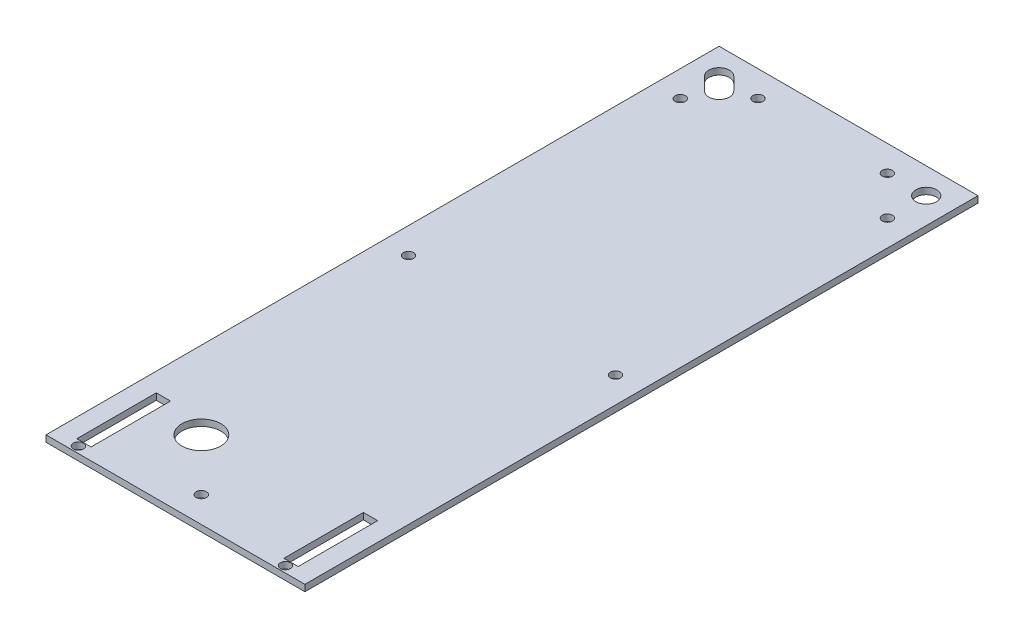
ISO-10303-21;
HEADER;
FILE_DESCRIPTION(('STEP AP214'),'2;1');
FILE_NAME('part.step','',(''),(''),'','','');
FILE_SCHEMA(('AUTOMOTIVE_DESIGN { 1 0 10303 214 1 1 1 1 }'));
ENDSEC;
DATA;
#1=APPLICATION_CONTEXT('core data for automotive mechanical design processes');
#2=APPLICATION_PROTOCOL_DEFINITION('international standard','automotive_design',2000,#1);
#3=PRODUCT_CONTEXT('',#1,'mechanical');
#4=PRODUCT('Part','Part','',(#3));
#5=PRODUCT_RELATED_PRODUCT_CATEGORY('part','',(#4));
#6=PRODUCT_DEFINITION_FORMATION('','',#4);
#7=PRODUCT_DEFINITION_CONTEXT('part definition',#1,'design');
#8=PRODUCT_DEFINITION('design','',#6,#7);
#9=PRODUCT_DEFINITION_SHAPE('','',#8);
#10=(LENGTH_UNIT() NAMED_UNIT(*) SI_UNIT(.MILLI.,.METRE.));
#11=(NAMED_UNIT(*) PLANE_ANGLE_UNIT() SI_UNIT($,.RADIAN.));
#12=(NAMED_UNIT(*) SI_UNIT($,.STERADIAN.) SOLID_ANGLE_UNIT());
#13=UNCERTAINTY_MEASURE_WITH_UNIT(LENGTH_MEASURE(1.E-05),#10,'distance_accuracy_value','');
#14=(GEOMETRIC_REPRESENTATION_CONTEXT(3) GLOBAL_UNCERTAINTY_ASSIGNED_CONTEXT((#13)) GLOBAL_UNIT_ASSIGNED_CONTEXT((#10,
#11,#12)) REPRESENTATION_CONTEXT('',''));
#15=CARTESIAN_POINT('',(0.,0.,0.));
#16=DIRECTION('',(0.,0.,1.));
#17=DIRECTION('',(1.,0.,0.));
#18=AXIS2_PLACEMENT_3D('',#15,#16,#17);
#19=CARTESIAN_POINT('',(0.,3.175,0.));
#20=DIRECTION('',(0.,1.,0.));
#21=DIRECTION('',(0.,0.,1.));
#22=AXIS2_PLACEMENT_3D('',#19,#20,#21);
#23=PLANE('',#22);
#24=CARTESIAN_POINT('',(-25.4,3.175,127.));
#25=DIRECTION('',(0.,1.,0.));
#26=DIRECTION('',(0.,0.,1.));
#27=AXIS2_PLACEMENT_3D('',#24,#25,#26);
#28=CIRCLE('',#27,9.525);
#29=CARTESIAN_POINT('',(-25.4,3.175,136.525));
#30=VERTEX_POINT('',#29);
#31=EDGE_CURVE('E185',#30,#30,#28,.T.);
#32=ORIENTED_EDGE('',*,*,#31,.F.);
#33=EDGE_LOOP('',(#32));
#34=FACE_BOUND('',#33,.T.);
#35=CARTESIAN_POINT('',(50.8000000000001,3.175,161.925));
#36=DIRECTION('',(0.,1.,0.));
#37=DIRECTION('',(0.,0.,1.));
#38=AXIS2_PLACEMENT_3D('',#35,#36,#37);
#39=CIRCLE('',#38,2.49999999999998);
#40=CARTESIAN_POINT('',(50.8000000000001,3.175,164.425));
#41=VERTEX_POINT('',#40);
#42=EDGE_CURVE('E213',#41,#41,#39,.F.);
#43=ORIENTED_EDGE('',*,*,#42,.T.);
#44=EDGE_LOOP('',(#43));
#45=FACE_BOUND('',#44,.T.);
#46=CARTESIAN_POINT('',(-50.8,3.175,0.));
#47=DIRECTION('',(0.,1.,0.));
#48=DIRECTION('',(0.,0.,1.));
#49=AXIS2_PLACEMENT_3D('',#46,#47,#48);
#50=CIRCLE('',#49,2.5);
#51=CARTESIAN_POINT('',(-50.8,3.175,2.5));
#52=VERTEX_POINT('',#51);
#53=EDGE_CURVE('E209',#52,#52,#50,.T.);
#54=ORIENTED_EDGE('',*,*,#53,.F.);
#55=EDGE_LOOP('',(#54));
#56=FACE_BOUND('',#55,.T.);
#57=CARTESIAN_POINT('',(50.8,3.175,-152.4));
#58=DIRECTION('',(0.,1.,0.));
#59=DIRECTION('',(0.,0.,1.));
#60=AXIS2_PLACEMENT_3D('',#57,#58,#59);
#61=CIRCLE('',#60,5.07999999999999);
#62=CARTESIAN_POINT('',(50.8,3.175,-147.32));
#63=VERTEX_POINT('',#62);
#64=EDGE_CURVE('E231',#63,#63,#61,.T.);
#65=ORIENTED_EDGE('',*,*,#64,.F.);
#66=EDGE_LOOP('',(#65));
#67=FACE_BOUND('',#66,.T.);
#68=CARTESIAN_POINT('',(-31.75,3.175,-152.4));
#69=DIRECTION('',(0.,1.,0.));
#70=DIRECTION('',(0.,0.,1.));
#71=AXIS2_PLACEMENT_3D('',#68,#69,#70);
#72=CIRCLE('',#71,2.5);
#73=CARTESIAN_POINT('',(-31.75,3.175,-149.9));
#74=VERTEX_POINT('',#73);
#75=EDGE_CURVE('E228',#74,#74,#72,.T.);
#76=ORIENTED_EDGE('',*,*,#75,.F.);
#77=EDGE_LOOP('',(#76));
#78=FACE_BOUND('',#77,.T.);
#79=CARTESIAN_POINT('',(50.8,3.175,0.));
#80=DIRECTION('',(0.,1.,0.));
#81=DIRECTION('',(0.,0.,1.));
#82=AXIS2_PLACEMENT_3D('',#79,#80,#81);
#83=CIRCLE('',#82,2.5);
#84=CARTESIAN_POINT('',(50.8,3.175,2.49999999999999));
#85=VERTEX_POINT('',#84);
#86=EDGE_CURVE('E206',#85,#85,#83,.F.);
#87=ORIENTED_EDGE('',*,*,#86,.T.);
#88=EDGE_LOOP('',(#87));
#89=FACE_BOUND('',#88,.T.);
#90=CARTESIAN_POINT('',(0.,3.175,152.4));
#91=DIRECTION('',(0.,1.,0.));
#92=DIRECTION('',(0.,0.,1.));
#93=AXIS2_PLACEMENT_3D('',#90,#91,#92);
#94=CIRCLE('',#93,2.5);
#95=CARTESIAN_POINT('',(0.,3.175,154.9));
#96=VERTEX_POINT('',#95);
#97=EDGE_CURVE('E210',#96,#96,#94,.T.);
#98=ORIENTED_EDGE('',*,*,#97,.F.);
#99=EDGE_LOOP('',(#98));
#100=FACE_BOUND('',#99,.T.);
#101=DIRECTION('',(0.,0.,1.));
#102=VECTOR('',#101,1.);
#103=CARTESIAN_POINT('',(-63.5,3.175,165.1));
#104=LINE('',#103,#102);
#105=CARTESIAN_POINT('',(-63.5,3.175,-165.1));
#106=VERTEX_POINT('',#105);
#107=CARTESIAN_POINT('',(-63.5,3.175,165.1));
#108=VERTEX_POINT('',#107);
#109=EDGE_CURVE('E258',#106,#108,#104,.T.);
#110=ORIENTED_EDGE('',*,*,#109,.T.);
#111=DIRECTION('',(1.,0.,0.));
#112=VECTOR('',#111,1.);
#113=CARTESIAN_POINT('',(63.5,3.175,165.1));
#114=LINE('',#113,#112);
#115=CARTESIAN_POINT('',(63.5,3.175,165.1));
#116=VERTEX_POINT('',#115);
#117=EDGE_CURVE('E261',#108,#116,#114,.T.);
#118=ORIENTED_EDGE('',*,*,#117,.T.);
#119=DIRECTION('',(0.,0.,-1.));
#120=VECTOR('',#119,1.);
#121=CARTESIAN_POINT('',(63.5,3.175,165.1));
#122=LINE('',#121,#120);
#123=CARTESIAN_POINT('',(63.5,3.175,-165.1));
#124=VERTEX_POINT('',#123);
#125=EDGE_CURVE('E264',#116,#124,#122,.T.);
#126=ORIENTED_EDGE('',*,*,#125,.T.);
#127=DIRECTION('',(-1.,0.,0.));
#128=VECTOR('',#127,1.);
#129=CARTESIAN_POINT('',(63.5,3.175,-165.1));
#130=LINE('',#129,#128);
#131=EDGE_CURVE('E266',#124,#106,#130,.T.);
#132=ORIENTED_EDGE('',*,*,#131,.T.);
#133=EDGE_LOOP('',(#110,#118,#126,#132));
#134=FACE_BOUND('',#133,.T.);
#135=CARTESIAN_POINT('',(-50.8,3.175,-152.4));
#136=DIRECTION('',(0.,1.,0.));
#137=DIRECTION('',(0.,0.,1.));
#138=AXIS2_PLACEMENT_3D('',#135,#136,#137);
#139=CIRCLE('',#138,5.08);
#140=CARTESIAN_POINT('',(-47.2078975515723,3.175,-155.992102448428));
#141=VERTEX_POINT('',#140);
#142=CARTESIAN_POINT('',(-54.3921024484277,3.175,-148.807897551572));
#143=VERTEX_POINT('',#142);
#144=EDGE_CURVE('E239',#141,#143,#139,.T.);
#145=ORIENTED_EDGE('',*,*,#144,.F.);
#146=DIRECTION('',(0.707106781186547,0.,0.707106781186548));
#147=VECTOR('',#146,1.);
#148=CARTESIAN_POINT('',(54.3921024484276,3.175,-54.3921024484275));
#149=LINE('',#148,#147);
#150=CARTESIAN_POINT('',(-40.8578975515723,3.175,-149.642102448428));
#151=VERTEX_POINT('',#150);
#152=EDGE_CURVE('E234',#141,#151,#149,.T.);
#153=ORIENTED_EDGE('',*,*,#152,.T.);
#154=CARTESIAN_POINT('',(-44.45,3.175,-146.05));
#155=DIRECTION('',(0.,1.,0.));
#156=DIRECTION('',(0.,0.,1.));
#157=AXIS2_PLACEMENT_3D('',#154,#155,#156);
#158=CIRCLE('',#157,5.08000000000002);
#159=CARTESIAN_POINT('',(-48.0421024484277,3.175,-142.457897551572));
#160=VERTEX_POINT('',#159);
#161=EDGE_CURVE('E245',#160,#151,#158,.T.);
#162=ORIENTED_EDGE('',*,*,#161,.F.);
#163=DIRECTION('',(0.707106781186544,0.,0.707106781186551));
#164=VECTOR('',#163,1.);
#165=CARTESIAN_POINT('',(47.207897551572,3.175,-47.2078975515715));
#166=LINE('',#165,#164);
#167=EDGE_CURVE('E242',#143,#160,#166,.T.);
#168=ORIENTED_EDGE('',*,*,#167,.F.);
#169=EDGE_LOOP('',(#145,#153,#162,#168));
#170=FACE_BOUND('',#169,.T.);
#171=CARTESIAN_POINT('',(-50.8,3.175,-133.35));
#172=DIRECTION('',(0.,1.,0.));
#173=DIRECTION('',(0.,0.,1.));
#174=AXIS2_PLACEMENT_3D('',#171,#172,#173);
#175=CIRCLE('',#174,2.5);
#176=CARTESIAN_POINT('',(-50.8,3.175,-130.85));
#177=VERTEX_POINT('',#176);
#178=EDGE_CURVE('E222',#177,#177,#175,.T.);
#179=ORIENTED_EDGE('',*,*,#178,.F.);
#180=EDGE_LOOP('',(#179));
#181=FACE_BOUND('',#180,.T.);
#182=CARTESIAN_POINT('',(31.75,3.175,-152.4));
#183=DIRECTION('',(0.,1.,0.));
#184=DIRECTION('',(0.,0.,1.));
#185=AXIS2_PLACEMENT_3D('',#182,#183,#184);
#186=CIRCLE('',#185,2.5);
#187=CARTESIAN_POINT('',(31.75,3.175,-149.9));
#188=VERTEX_POINT('',#187);
#189=EDGE_CURVE('E225',#188,#188,#186,.F.);
#190=ORIENTED_EDGE('',*,*,#189,.T.);
#191=EDGE_LOOP('',(#190));
#192=FACE_BOUND('',#191,.T.);
#193=CARTESIAN_POINT('',(-50.8,3.175,161.925));
#194=DIRECTION('',(0.,1.,0.));
#195=DIRECTION('',(0.,0.,1.));
#196=AXIS2_PLACEMENT_3D('',#193,#194,#195);
#197=CIRCLE('',#196,2.5);
#198=CARTESIAN_POINT('',(-50.8,3.175,164.425));
#199=VERTEX_POINT('',#198);
#200=EDGE_CURVE('E216',#199,#199,#197,.T.);
#201=ORIENTED_EDGE('',*,*,#200,.F.);
#202=EDGE_LOOP('',(#201));
#203=FACE_BOUND('',#202,.T.);
#204=CARTESIAN_POINT('',(50.8,3.175,-133.35));
#205=DIRECTION('',(0.,1.,0.));
#206=DIRECTION('',(0.,0.,1.));
#207=AXIS2_PLACEMENT_3D('',#204,#205,#206);
#208=CIRCLE('',#207,2.5);
#209=CARTESIAN_POINT('',(50.8,3.175,-130.85));
#210=VERTEX_POINT('',#209);
#211=EDGE_CURVE('E219',#210,#210,#208,.F.);
#212=ORIENTED_EDGE('',*,*,#211,.T.);
#213=EDGE_LOOP('',(#212));
#214=FACE_BOUND('',#213,.T.);
#215=DIRECTION('',(-1.,0.,0.));
#216=VECTOR('',#215,1.);
#217=CARTESIAN_POINT('',(0.,3.175,120.2));
#218=LINE('',#217,#216);
#219=CARTESIAN_POINT('',(54.3,3.175,120.2));
#220=VERTEX_POINT('',#219);
#221=CARTESIAN_POINT('',(47.3,3.175,120.2));
#222=VERTEX_POINT('',#221);
#223=EDGE_CURVE('E190',#220,#222,#218,.T.);
#224=ORIENTED_EDGE('',*,*,#223,.F.);
#225=DIRECTION('',(0.,0.,1.));
#226=VECTOR('',#225,1.);
#227=CARTESIAN_POINT('',(54.3,3.175,0.));
#228=LINE('',#227,#226);
#229=CARTESIAN_POINT('',(54.3,3.175,159.2));
#230=VERTEX_POINT('',#229);
#231=EDGE_CURVE('E64',#220,#230,#228,.T.);
#232=ORIENTED_EDGE('',*,*,#231,.T.);
#233=DIRECTION('',(-1.,0.,0.));
#234=VECTOR('',#233,1.);
#235=CARTESIAN_POINT('',(0.,3.175,159.2));
#236=LINE('',#235,#234);
#237=CARTESIAN_POINT('',(47.3,3.175,159.2));
#238=VERTEX_POINT('',#237);
#239=EDGE_CURVE('E196',#230,#238,#236,.T.);
#240=ORIENTED_EDGE('',*,*,#239,.T.);
#241=DIRECTION('',(0.,0.,-1.));
#242=VECTOR('',#241,1.);
#243=CARTESIAN_POINT('',(47.3,3.175,0.));
#244=LINE('',#243,#242);
#245=EDGE_CURVE('E193',#238,#222,#244,.T.);
#246=ORIENTED_EDGE('',*,*,#245,.T.);
#247=EDGE_LOOP('',(#224,#232,#240,#246));
#248=FACE_BOUND('',#247,.T.);
#249=DIRECTION('',(1.,0.,0.));
#250=VECTOR('',#249,1.);
#251=CARTESIAN_POINT('',(0.,3.175,159.2));
#252=LINE('',#251,#250);
#253=CARTESIAN_POINT('',(-54.3,3.175,159.2));
#254=VERTEX_POINT('',#253);
#255=CARTESIAN_POINT('',(-47.3,3.175,159.2));
#256=VERTEX_POINT('',#255);
#257=EDGE_CURVE('E170',#254,#256,#252,.T.);
#258=ORIENTED_EDGE('',*,*,#257,.F.);
#259=DIRECTION('',(0.,0.,-1.));
#260=VECTOR('',#259,1.);
#261=CARTESIAN_POINT('',(-54.3,3.175,0.));
#262=LINE('',#261,#260);
#263=CARTESIAN_POINT('',(-54.3,3.175,120.2));
#264=VERTEX_POINT('',#263);
#265=EDGE_CURVE('E56',#254,#264,#262,.T.);
#266=ORIENTED_EDGE('',*,*,#265,.T.);
#267=DIRECTION('',(1.,0.,0.));
#268=VECTOR('',#267,1.);
#269=CARTESIAN_POINT('',(0.,3.175,120.2));
#270=LINE('',#269,#268);
#271=CARTESIAN_POINT('',(-47.3,3.175,120.2));
#272=VERTEX_POINT('',#271);
#273=EDGE_CURVE('E175',#264,#272,#270,.T.);
#274=ORIENTED_EDGE('',*,*,#273,.T.);
#275=DIRECTION('',(0.,0.,1.));
#276=VECTOR('',#275,1.);
#277=CARTESIAN_POINT('',(-47.3,3.175,0.));
#278=LINE('',#277,#276);
#279=EDGE_CURVE('E160',#272,#256,#278,.T.);
#280=ORIENTED_EDGE('',*,*,#279,.T.);
#281=EDGE_LOOP('',(#258,#266,#274,#280));
#282=FACE_BOUND('',#281,.T.);
#283=ADVANCED_FACE('F41',(#34,#45,#56,#67,#78,#89,#100,#134,#170,#181,#192,#203,#214,#248,#282),
#23,.T.);
#284=CARTESIAN_POINT('',(0.,0.,0.));
#285=DIRECTION('',(0.,1.,0.));
#286=DIRECTION('',(0.,0.,1.));
#287=AXIS2_PLACEMENT_3D('',#284,#285,#286);
#288=PLANE('',#287);
#289=DIRECTION('',(0.,0.,1.));
#290=VECTOR('',#289,1.);
#291=CARTESIAN_POINT('',(54.3,0.,0.));
#292=LINE('',#291,#290);
#293=CARTESIAN_POINT('',(54.3,0.,120.2));
#294=VERTEX_POINT('',#293);
#295=CARTESIAN_POINT('',(54.3,0.,159.2));
#296=VERTEX_POINT('',#295);
#297=EDGE_CURVE('E336',#294,#296,#292,.T.);
#298=ORIENTED_EDGE('',*,*,#297,.F.);
#299=DIRECTION('',(-1.,0.,0.));
#300=VECTOR('',#299,1.);
#301=CARTESIAN_POINT('',(0.,0.,120.2));
#302=LINE('',#301,#300);
#303=CARTESIAN_POINT('',(47.3,0.,120.2));
#304=VERTEX_POINT('',#303);
#305=EDGE_CURVE('E300',#294,#304,#302,.T.);
#306=ORIENTED_EDGE('',*,*,#305,.T.);
#307=DIRECTION('',(0.,0.,-1.));
#308=VECTOR('',#307,1.);
#309=CARTESIAN_POINT('',(47.3,0.,0.));
#310=LINE('',#309,#308);
#311=CARTESIAN_POINT('',(47.3,0.,159.2));
#312=VERTEX_POINT('',#311);
#313=EDGE_CURVE('E331',#312,#304,#310,.T.);
#314=ORIENTED_EDGE('',*,*,#313,.F.);
#315=DIRECTION('',(-1.,0.,0.));
#316=VECTOR('',#315,1.);
#317=CARTESIAN_POINT('',(0.,0.,159.2));
#318=LINE('',#317,#316);
#319=EDGE_CURVE('E334',#296,#312,#318,.T.);
#320=ORIENTED_EDGE('',*,*,#319,.F.);
#321=EDGE_LOOP('',(#298,#306,#314,#320));
#322=FACE_BOUND('',#321,.T.);
#323=CARTESIAN_POINT('',(-50.8,0.,161.925));
#324=DIRECTION('',(0.,1.,0.));
#325=DIRECTION('',(0.,0.,1.));
#326=AXIS2_PLACEMENT_3D('',#323,#324,#325);
#327=CIRCLE('',#326,2.5);
#328=CARTESIAN_POINT('',(-50.8,0.,164.425));
#329=VERTEX_POINT('',#328);
#330=EDGE_CURVE('E324',#329,#329,#327,.T.);
#331=ORIENTED_EDGE('',*,*,#330,.T.);
#332=EDGE_LOOP('',(#331));
#333=FACE_BOUND('',#332,.T.);
#334=CARTESIAN_POINT('',(-50.8,0.,0.));
#335=DIRECTION('',(0.,1.,0.));
#336=DIRECTION('',(0.,0.,1.));
#337=AXIS2_PLACEMENT_3D('',#334,#335,#336);
#338=CIRCLE('',#337,2.5);
#339=CARTESIAN_POINT('',(-50.8,0.,2.5));
#340=VERTEX_POINT('',#339);
#341=EDGE_CURVE('E318',#340,#340,#338,.T.);
#342=ORIENTED_EDGE('',*,*,#341,.T.);
#343=EDGE_LOOP('',(#342));
#344=FACE_BOUND('',#343,.T.);
#345=CARTESIAN_POINT('',(50.8,0.,-152.4));
#346=DIRECTION('',(0.,1.,0.));
#347=DIRECTION('',(0.,0.,1.));
#348=AXIS2_PLACEMENT_3D('',#345,#346,#347);
#349=CIRCLE('',#348,5.07999999999999);
#350=CARTESIAN_POINT('',(50.8,0.,-147.32));
#351=VERTEX_POINT('',#350);
#352=EDGE_CURVE('E315',#351,#351,#349,.T.);
#353=ORIENTED_EDGE('',*,*,#352,.T.);
#354=EDGE_LOOP('',(#353));
#355=FACE_BOUND('',#354,.T.);
#356=CARTESIAN_POINT('',(-31.75,0.,-152.4));
#357=DIRECTION('',(0.,1.,0.));
#358=DIRECTION('',(0.,0.,1.));
#359=AXIS2_PLACEMENT_3D('',#356,#357,#358);
#360=CIRCLE('',#359,2.5);
#361=CARTESIAN_POINT('',(-31.75,0.,-149.9));
#362=VERTEX_POINT('',#361);
#363=EDGE_CURVE('E312',#362,#362,#360,.T.);
#364=ORIENTED_EDGE('',*,*,#363,.T.);
#365=EDGE_LOOP('',(#364));
#366=FACE_BOUND('',#365,.T.);
#367=CARTESIAN_POINT('',(-50.8,0.,-133.35));
#368=DIRECTION('',(0.,1.,0.));
#369=DIRECTION('',(0.,0.,1.));
#370=AXIS2_PLACEMENT_3D('',#367,#368,#369);
#371=CIRCLE('',#370,2.5);
#372=CARTESIAN_POINT('',(-50.8,0.,-130.85));
#373=VERTEX_POINT('',#372);
#374=EDGE_CURVE('E306',#373,#373,#371,.T.);
#375=ORIENTED_EDGE('',*,*,#374,.T.);
#376=EDGE_LOOP('',(#375));
#377=FACE_BOUND('',#376,.T.);
#378=CARTESIAN_POINT('',(0.,0.,152.4));
#379=DIRECTION('',(0.,1.,0.));
#380=DIRECTION('',(0.,0.,1.));
#381=AXIS2_PLACEMENT_3D('',#378,#379,#380);
#382=CIRCLE('',#381,2.5);
#383=CARTESIAN_POINT('',(0.,0.,154.9));
#384=VERTEX_POINT('',#383);
#385=EDGE_CURVE('E251',#384,#384,#382,.T.);
#386=ORIENTED_EDGE('',*,*,#385,.T.);
#387=EDGE_LOOP('',(#386));
#388=FACE_BOUND('',#387,.T.);
#389=DIRECTION('',(0.,0.,1.));
#390=VECTOR('',#389,1.);
#391=CARTESIAN_POINT('',(-63.5,0.,165.1));
#392=LINE('',#391,#390);
#393=CARTESIAN_POINT('',(-63.5,0.,-165.1));
#394=VERTEX_POINT('',#393);
#395=CARTESIAN_POINT('',(-63.5,0.,165.1));
#396=VERTEX_POINT('',#395);
#397=EDGE_CURVE('E269',#394,#396,#392,.T.);
#398=ORIENTED_EDGE('',*,*,#397,.F.);
#399=DIRECTION('',(-1.,0.,0.));
#400=VECTOR('',#399,1.);
#401=CARTESIAN_POINT('',(63.5,0.,-165.1));
#402=LINE('',#401,#400);
#403=CARTESIAN_POINT('',(63.5,0.,-165.1));
#404=VERTEX_POINT('',#403);
#405=EDGE_CURVE('E262',#404,#394,#402,.T.);
#406=ORIENTED_EDGE('',*,*,#405,.F.);
#407=DIRECTION('',(0.,0.,-1.));
#408=VECTOR('',#407,1.);
#409=CARTESIAN_POINT('',(63.5,0.,165.1));
#410=LINE('',#409,#408);
#411=CARTESIAN_POINT('',(63.5,0.,165.1));
#412=VERTEX_POINT('',#411);
#413=EDGE_CURVE('E275',#412,#404,#410,.T.);
#414=ORIENTED_EDGE('',*,*,#413,.F.);
#415=DIRECTION('',(1.,0.,0.));
#416=VECTOR('',#415,1.);
#417=CARTESIAN_POINT('',(63.5,0.,165.1));
#418=LINE('',#417,#416);
#419=EDGE_CURVE('E272',#396,#412,#418,.T.);
#420=ORIENTED_EDGE('',*,*,#419,.F.);
#421=EDGE_LOOP('',(#398,#406,#414,#420));
#422=FACE_BOUND('',#421,.T.);
#423=DIRECTION('',(0.707106781186547,0.,0.707106781186548));
#424=VECTOR('',#423,1.);
#425=CARTESIAN_POINT('',(54.3921024484276,0.,-54.3921024484275));
#426=LINE('',#425,#424);
#427=CARTESIAN_POINT('',(-47.2078975515723,0.,-155.992102448428));
#428=VERTEX_POINT('',#427);
#429=CARTESIAN_POINT('',(-40.8578975515723,0.,-149.642102448428));
#430=VERTEX_POINT('',#429);
#431=EDGE_CURVE('E298',#428,#430,#426,.T.);
#432=ORIENTED_EDGE('',*,*,#431,.F.);
#433=CARTESIAN_POINT('',(-50.8,0.,-152.4));
#434=DIRECTION('',(0.,1.,0.));
#435=DIRECTION('',(0.,0.,1.));
#436=AXIS2_PLACEMENT_3D('',#433,#434,#435);
#437=CIRCLE('',#436,5.08);
#438=CARTESIAN_POINT('',(-54.3921024484277,0.,-148.807897551572));
#439=VERTEX_POINT('',#438);
#440=EDGE_CURVE('E289',#428,#439,#437,.T.);
#441=ORIENTED_EDGE('',*,*,#440,.T.);
#442=DIRECTION('',(0.707106781186544,0.,0.707106781186551));
#443=VECTOR('',#442,1.);
#444=CARTESIAN_POINT('',(47.207897551572,0.,-47.2078975515715));
#445=LINE('',#444,#443);
#446=CARTESIAN_POINT('',(-48.0421024484277,0.,-142.457897551572));
#447=VERTEX_POINT('',#446);
#448=EDGE_CURVE('E292',#439,#447,#445,.T.);
#449=ORIENTED_EDGE('',*,*,#448,.T.);
#450=CARTESIAN_POINT('',(-44.45,0.,-146.05));
#451=DIRECTION('',(0.,1.,0.));
#452=DIRECTION('',(0.,0.,1.));
#453=AXIS2_PLACEMENT_3D('',#450,#451,#452);
#454=CIRCLE('',#453,5.08000000000002);
#455=EDGE_CURVE('E295',#447,#430,#454,.T.);
#456=ORIENTED_EDGE('',*,*,#455,.T.);
#457=EDGE_LOOP('',(#432,#441,#449,#456));
#458=FACE_BOUND('',#457,.T.);
#459=CARTESIAN_POINT('',(50.8,0.,0.));
#460=DIRECTION('',(0.,1.,0.));
#461=DIRECTION('',(0.,0.,1.));
#462=AXIS2_PLACEMENT_3D('',#459,#460,#461);
#463=CIRCLE('',#462,2.5);
#464=CARTESIAN_POINT('',(50.8,0.,2.49999999999999));
#465=VERTEX_POINT('',#464);
#466=EDGE_CURVE('E303',#465,#465,#463,.F.);
#467=ORIENTED_EDGE('',*,*,#466,.F.);
#468=EDGE_LOOP('',(#467));
#469=FACE_BOUND('',#468,.T.);
#470=CARTESIAN_POINT('',(31.75,0.,-152.4));
#471=DIRECTION('',(0.,1.,0.));
#472=DIRECTION('',(0.,0.,1.));
#473=AXIS2_PLACEMENT_3D('',#470,#471,#472);
#474=CIRCLE('',#473,2.5);
#475=CARTESIAN_POINT('',(31.75,0.,-149.9));
#476=VERTEX_POINT('',#475);
#477=EDGE_CURVE('E309',#476,#476,#474,.F.);
#478=ORIENTED_EDGE('',*,*,#477,.F.);
#479=EDGE_LOOP('',(#478));
#480=FACE_BOUND('',#479,.T.);
#481=CARTESIAN_POINT('',(50.8000000000001,0.,161.925));
#482=DIRECTION('',(0.,1.,0.));
#483=DIRECTION('',(0.,0.,1.));
#484=AXIS2_PLACEMENT_3D('',#481,#482,#483);
#485=CIRCLE('',#484,2.49999999999998);
#486=CARTESIAN_POINT('',(50.8000000000001,0.,164.425));
#487=VERTEX_POINT('',#486);
#488=EDGE_CURVE('E321',#487,#487,#485,.F.);
#489=ORIENTED_EDGE('',*,*,#488,.F.);
#490=EDGE_LOOP('',(#489));
#491=FACE_BOUND('',#490,.T.);
#492=CARTESIAN_POINT('',(50.8,0.,-133.35));
#493=DIRECTION('',(0.,1.,0.));
#494=DIRECTION('',(0.,0.,1.));
#495=AXIS2_PLACEMENT_3D('',#492,#493,#494);
#496=CIRCLE('',#495,2.5);
#497=CARTESIAN_POINT('',(50.8,0.,-130.85));
#498=VERTEX_POINT('',#497);
#499=EDGE_CURVE('E273',#498,#498,#496,.F.);
#500=ORIENTED_EDGE('',*,*,#499,.F.);
#501=EDGE_LOOP('',(#500));
#502=FACE_BOUND('',#501,.T.);
#503=CARTESIAN_POINT('',(-25.4,0.,127.));
#504=DIRECTION('',(0.,1.,0.));
#505=DIRECTION('',(0.,0.,1.));
#506=AXIS2_PLACEMENT_3D('',#503,#504,#505);
#507=CIRCLE('',#506,9.525);
#508=CARTESIAN_POINT('',(-25.4,0.,136.525));
#509=VERTEX_POINT('',#508);
#510=EDGE_CURVE('E182',#509,#509,#507,.T.);
#511=ORIENTED_EDGE('',*,*,#510,.T.);
#512=EDGE_LOOP('',(#511));
#513=FACE_BOUND('',#512,.T.);
#514=DIRECTION('',(0.,0.,-1.));
#515=VECTOR('',#514,1.);
#516=CARTESIAN_POINT('',(-54.3,0.,0.));
#517=LINE('',#516,#515);
#518=CARTESIAN_POINT('',(-54.3,0.,159.2));
#519=VERTEX_POINT('',#518);
#520=CARTESIAN_POINT('',(-54.3,0.,120.2));
#521=VERTEX_POINT('',#520);
#522=EDGE_CURVE('E11',#519,#521,#517,.T.);
#523=ORIENTED_EDGE('',*,*,#522,.F.);
#524=DIRECTION('',(1.,0.,0.));
#525=VECTOR('',#524,1.);
#526=CARTESIAN_POINT('',(0.,0.,159.2));
#527=LINE('',#526,#525);
#528=CARTESIAN_POINT('',(-47.3,0.,159.2));
#529=VERTEX_POINT('',#528);
#530=EDGE_CURVE('E338',#519,#529,#527,.T.);
#531=ORIENTED_EDGE('',*,*,#530,.T.);
#532=DIRECTION('',(0.,0.,1.));
#533=VECTOR('',#532,1.);
#534=CARTESIAN_POINT('',(-47.3,0.,0.));
#535=LINE('',#534,#533);
#536=CARTESIAN_POINT('',(-47.3,0.,120.2));
#537=VERTEX_POINT('',#536);
#538=EDGE_CURVE('E163',#537,#529,#535,.T.);
#539=ORIENTED_EDGE('',*,*,#538,.F.);
#540=DIRECTION('',(1.,0.,0.));
#541=VECTOR('',#540,1.);
#542=CARTESIAN_POINT('',(0.,0.,120.2));
#543=LINE('',#542,#541);
#544=EDGE_CURVE('E49',#521,#537,#543,.T.);
#545=ORIENTED_EDGE('',*,*,#544,.F.);
#546=EDGE_LOOP('',(#523,#531,#539,#545));
#547=FACE_BOUND('',#546,.T.);
#548=ADVANCED_FACE('F348',(#322,#333,#344,#355,#366,#377,#388,#422,#458,#469,#480,#491,#502,
#513,#547),#288,.F.);
#549=CARTESIAN_POINT('',(-63.5,3.175,165.1));
#550=DIRECTION('',(1.,0.,0.));
#551=DIRECTION('',(0.,0.,-1.));
#552=AXIS2_PLACEMENT_3D('',#549,#550,#551);
#553=PLANE('',#552);
#554=ORIENTED_EDGE('',*,*,#397,.T.);
#555=DIRECTION('',(0.,-1.,0.));
#556=VECTOR('',#555,1.);
#557=CARTESIAN_POINT('',(-63.5,3.175,165.1));
#558=LINE('',#557,#556);
#559=EDGE_CURVE('E286',#108,#396,#558,.T.);
#560=ORIENTED_EDGE('',*,*,#559,.F.);
#561=ORIENTED_EDGE('',*,*,#109,.F.);
#562=DIRECTION('',(0.,-1.,0.));
#563=VECTOR('',#562,1.);
#564=CARTESIAN_POINT('',(-63.5,3.175,-165.1));
#565=LINE('',#564,#563);
#566=EDGE_CURVE('E268',#106,#394,#565,.T.);
#567=ORIENTED_EDGE('',*,*,#566,.T.);
#568=EDGE_LOOP('',(#554,#560,#561,#567));
#569=FACE_BOUND('',#568,.T.);
#570=ADVANCED_FACE('F43',(#569),#553,.F.);
#571=CARTESIAN_POINT('',(63.5,3.175,165.1));
#572=DIRECTION('',(0.,0.,-1.));
#573=DIRECTION('',(-1.,0.,0.));
#574=AXIS2_PLACEMENT_3D('',#571,#572,#573);
#575=PLANE('',#574);
#576=ORIENTED_EDGE('',*,*,#419,.T.);
#577=DIRECTION('',(0.,-1.,0.));
#578=VECTOR('',#577,1.);
#579=CARTESIAN_POINT('',(63.5,3.175,165.1));
#580=LINE('',#579,#578);
#581=EDGE_CURVE('E283',#116,#412,#580,.T.);
#582=ORIENTED_EDGE('',*,*,#581,.F.);
#583=ORIENTED_EDGE('',*,*,#117,.F.);
#584=ORIENTED_EDGE('',*,*,#559,.T.);
#585=EDGE_LOOP('',(#576,#582,#583,#584));
#586=FACE_BOUND('',#585,.T.);
#587=ADVANCED_FACE('F383',(#586),#575,.F.);
#588=CARTESIAN_POINT('',(63.5,3.175,165.1));
#589=DIRECTION('',(-1.,0.,0.));
#590=DIRECTION('',(0.,0.,1.));
#591=AXIS2_PLACEMENT_3D('',#588,#589,#590);
#592=PLANE('',#591);
#593=ORIENTED_EDGE('',*,*,#413,.T.);
#594=DIRECTION('',(0.,-1.,0.));
#595=VECTOR('',#594,1.);
#596=CARTESIAN_POINT('',(63.5,3.175,-165.1));
#597=LINE('',#596,#595);
#598=EDGE_CURVE('E280',#124,#404,#597,.T.);
#599=ORIENTED_EDGE('',*,*,#598,.F.);
#600=ORIENTED_EDGE('',*,*,#125,.F.);
#601=ORIENTED_EDGE('',*,*,#581,.T.);
#602=EDGE_LOOP('',(#593,#599,#600,#601));
#603=FACE_BOUND('',#602,.T.);
#604=ADVANCED_FACE('F380',(#603),#592,.F.);
#605=CARTESIAN_POINT('',(63.5,3.175,-165.1));
#606=DIRECTION('',(0.,0.,1.));
#607=DIRECTION('',(1.,0.,0.));
#608=AXIS2_PLACEMENT_3D('',#605,#606,#607);
#609=PLANE('',#608);
#610=ORIENTED_EDGE('',*,*,#405,.T.);
#611=ORIENTED_EDGE('',*,*,#566,.F.);
#612=ORIENTED_EDGE('',*,*,#131,.F.);
#613=ORIENTED_EDGE('',*,*,#598,.T.);
#614=EDGE_LOOP('',(#610,#611,#612,#613));
#615=FACE_BOUND('',#614,.T.);
#616=ADVANCED_FACE('F377',(#615),#609,.F.);
#617=CARTESIAN_POINT('',(54.3921024484276,-22.225,-54.3921024484275));
#618=DIRECTION('',(-0.707106781186548,0.,0.707106781186547));
#619=DIRECTION('',(0.707106781186547,0.,0.707106781186548));
#620=AXIS2_PLACEMENT_3D('',#617,#618,#619);
#621=PLANE('',#620);
#622=ORIENTED_EDGE('',*,*,#431,.T.);
#623=DIRECTION('',(0.,1.,0.));
#624=VECTOR('',#623,1.);
#625=CARTESIAN_POINT('',(-40.8578975515723,-22.225,-149.642102448428));
#626=LINE('',#625,#624);
#627=EDGE_CURVE('E249',#430,#151,#626,.T.);
#628=ORIENTED_EDGE('',*,*,#627,.T.);
#629=ORIENTED_EDGE('',*,*,#152,.F.);
#630=DIRECTION('',(0.,1.,0.));
#631=VECTOR('',#630,1.);
#632=CARTESIAN_POINT('',(-47.2078975515723,-22.225,-155.992102448428));
#633=LINE('',#632,#631);
#634=EDGE_CURVE('E248',#428,#141,#633,.T.);
#635=ORIENTED_EDGE('',*,*,#634,.F.);
#636=EDGE_LOOP('',(#622,#628,#629,#635));
#637=FACE_BOUND('',#636,.T.);
#638=ADVANCED_FACE('F374',(#637),#621,.T.);
#639=CARTESIAN_POINT('',(-44.45,-22.225,-146.05));
#640=DIRECTION('',(0.,1.,0.));
#641=DIRECTION('',(0.,0.,1.));
#642=AXIS2_PLACEMENT_3D('',#639,#640,#641);
#643=CYLINDRICAL_SURFACE('',#642,5.08000000000002);
#644=DIRECTION('',(0.,1.,0.));
#645=VECTOR('',#644,1.);
#646=CARTESIAN_POINT('',(-48.0421024484277,-22.225,-142.457897551572));
#647=LINE('',#646,#645);
#648=EDGE_CURVE('E252',#447,#160,#647,.T.);
#649=ORIENTED_EDGE('',*,*,#648,.T.);
#650=ORIENTED_EDGE('',*,*,#161,.T.);
#651=ORIENTED_EDGE('',*,*,#627,.F.);
#652=ORIENTED_EDGE('',*,*,#455,.F.);
#653=EDGE_LOOP('',(#649,#650,#651,#652));
#654=FACE_BOUND('',#653,.T.);
#655=ADVANCED_FACE('F482',(#654),#643,.F.);
#656=CARTESIAN_POINT('',(47.207897551572,-22.225,-47.2078975515715));
#657=DIRECTION('',(-0.707106781186551,0.,0.707106781186544));
#658=DIRECTION('',(0.707106781186544,0.,0.707106781186551));
#659=AXIS2_PLACEMENT_3D('',#656,#657,#658);
#660=PLANE('',#659);
#661=DIRECTION('',(0.,1.,0.));
#662=VECTOR('',#661,1.);
#663=CARTESIAN_POINT('',(-54.3921024484277,-22.225,-148.807897551572));
#664=LINE('',#663,#662);
#665=EDGE_CURVE('E254',#439,#143,#664,.T.);
#666=ORIENTED_EDGE('',*,*,#665,.T.);
#667=ORIENTED_EDGE('',*,*,#167,.T.);
#668=ORIENTED_EDGE('',*,*,#648,.F.);
#669=ORIENTED_EDGE('',*,*,#448,.F.);
#670=EDGE_LOOP('',(#666,#667,#668,#669));
#671=FACE_BOUND('',#670,.T.);
#672=ADVANCED_FACE('F485',(#671),#660,.F.);
#673=CARTESIAN_POINT('',(-50.8,-22.225,-152.4));
#674=DIRECTION('',(0.,1.,0.));
#675=DIRECTION('',(0.,0.,1.));
#676=AXIS2_PLACEMENT_3D('',#673,#674,#675);
#677=CYLINDRICAL_SURFACE('',#676,5.08);
#678=ORIENTED_EDGE('',*,*,#634,.T.);
#679=ORIENTED_EDGE('',*,*,#144,.T.);
#680=ORIENTED_EDGE('',*,*,#665,.F.);
#681=ORIENTED_EDGE('',*,*,#440,.F.);
#682=EDGE_LOOP('',(#678,#679,#680,#681));
#683=FACE_BOUND('',#682,.T.);
#684=ADVANCED_FACE('F451',(#683),#677,.F.);
#685=CARTESIAN_POINT('',(0.,-22.225,152.4));
#686=DIRECTION('',(0.,1.,0.));
#687=DIRECTION('',(0.,0.,1.));
#688=AXIS2_PLACEMENT_3D('',#685,#686,#687);
#689=CYLINDRICAL_SURFACE('',#688,2.5);
#690=ORIENTED_EDGE('',*,*,#97,.T.);
#691=EDGE_LOOP('',(#690));
#692=FACE_BOUND('',#691,.T.);
#693=ORIENTED_EDGE('',*,*,#385,.F.);
#694=EDGE_LOOP('',(#693));
#695=FACE_BOUND('',#694,.T.);
#696=ADVANCED_FACE('F447',(#692,#695),#689,.F.);
#697=CARTESIAN_POINT('',(50.8,-22.225,0.));
#698=DIRECTION('',(0.,1.,0.));
#699=DIRECTION('',(0.,0.,1.));
#700=AXIS2_PLACEMENT_3D('',#697,#698,#699);
#701=CYLINDRICAL_SURFACE('',#700,2.5);
#702=ORIENTED_EDGE('',*,*,#86,.F.);
#703=EDGE_LOOP('',(#702));
#704=FACE_BOUND('',#703,.T.);
#705=ORIENTED_EDGE('',*,*,#466,.T.);
#706=EDGE_LOOP('',(#705));
#707=FACE_BOUND('',#706,.T.);
#708=ADVANCED_FACE('F443',(#704,#707),#701,.F.);
#709=CARTESIAN_POINT('',(-50.8,-22.225,-133.35));
#710=DIRECTION('',(0.,1.,0.));
#711=DIRECTION('',(0.,0.,1.));
#712=AXIS2_PLACEMENT_3D('',#709,#710,#711);
#713=CYLINDRICAL_SURFACE('',#712,2.5);
#714=ORIENTED_EDGE('',*,*,#178,.T.);
#715=EDGE_LOOP('',(#714));
#716=FACE_BOUND('',#715,.T.);
#717=ORIENTED_EDGE('',*,*,#374,.F.);
#718=EDGE_LOOP('',(#717));
#719=FACE_BOUND('',#718,.T.);
#720=ADVANCED_FACE('F446',(#716,#719),#713,.F.);
#721=CARTESIAN_POINT('',(31.75,-22.225,-152.4));
#722=DIRECTION('',(0.,1.,0.));
#723=DIRECTION('',(0.,0.,1.));
#724=AXIS2_PLACEMENT_3D('',#721,#722,#723);
#725=CYLINDRICAL_SURFACE('',#724,2.5);
#726=ORIENTED_EDGE('',*,*,#189,.F.);
#727=EDGE_LOOP('',(#726));
#728=FACE_BOUND('',#727,.T.);
#729=ORIENTED_EDGE('',*,*,#477,.T.);
#730=EDGE_LOOP('',(#729));
#731=FACE_BOUND('',#730,.T.);
#732=ADVANCED_FACE('F468',(#728,#731),#725,.F.);
#733=CARTESIAN_POINT('',(-31.75,-22.225,-152.4));
#734=DIRECTION('',(0.,1.,0.));
#735=DIRECTION('',(0.,0.,1.));
#736=AXIS2_PLACEMENT_3D('',#733,#734,#735);
#737=CYLINDRICAL_SURFACE('',#736,2.5);
#738=ORIENTED_EDGE('',*,*,#75,.T.);
#739=EDGE_LOOP('',(#738));
#740=FACE_BOUND('',#739,.T.);
#741=ORIENTED_EDGE('',*,*,#363,.F.);
#742=EDGE_LOOP('',(#741));
#743=FACE_BOUND('',#742,.T.);
#744=ADVANCED_FACE('F471',(#740,#743),#737,.F.);
#745=CARTESIAN_POINT('',(50.8,-22.225,-152.4));
#746=DIRECTION('',(0.,1.,0.));
#747=DIRECTION('',(0.,0.,1.));
#748=AXIS2_PLACEMENT_3D('',#745,#746,#747);
#749=CYLINDRICAL_SURFACE('',#748,5.07999999999999);
#750=ORIENTED_EDGE('',*,*,#64,.T.);
#751=EDGE_LOOP('',(#750));
#752=FACE_BOUND('',#751,.T.);
#753=ORIENTED_EDGE('',*,*,#352,.F.);
#754=EDGE_LOOP('',(#753));
#755=FACE_BOUND('',#754,.T.);
#756=ADVANCED_FACE('F461',(#752,#755),#749,.F.);
#757=CARTESIAN_POINT('',(-50.8,-22.225,0.));
#758=DIRECTION('',(0.,1.,0.));
#759=DIRECTION('',(0.,0.,1.));
#760=AXIS2_PLACEMENT_3D('',#757,#758,#759);
#761=CYLINDRICAL_SURFACE('',#760,2.5);
#762=ORIENTED_EDGE('',*,*,#53,.T.);
#763=EDGE_LOOP('',(#762));
#764=FACE_BOUND('',#763,.T.);
#765=ORIENTED_EDGE('',*,*,#341,.F.);
#766=EDGE_LOOP('',(#765));
#767=FACE_BOUND('',#766,.T.);
#768=ADVANCED_FACE('F457',(#764,#767),#761,.F.);
#769=CARTESIAN_POINT('',(50.8000000000001,-22.225,161.925));
#770=DIRECTION('',(0.,1.,0.));
#771=DIRECTION('',(0.,0.,1.));
#772=AXIS2_PLACEMENT_3D('',#769,#770,#771);
#773=CYLINDRICAL_SURFACE('',#772,2.49999999999998);
#774=ORIENTED_EDGE('',*,*,#42,.F.);
#775=EDGE_LOOP('',(#774));
#776=FACE_BOUND('',#775,.T.);
#777=ORIENTED_EDGE('',*,*,#488,.T.);
#778=EDGE_LOOP('',(#777));
#779=FACE_BOUND('',#778,.T.);
#780=ADVANCED_FACE('F453',(#776,#779),#773,.F.);
#781=CARTESIAN_POINT('',(-50.8,-22.225,161.925));
#782=DIRECTION('',(0.,1.,0.));
#783=DIRECTION('',(0.,0.,1.));
#784=AXIS2_PLACEMENT_3D('',#781,#782,#783);
#785=CYLINDRICAL_SURFACE('',#784,2.5);
#786=ORIENTED_EDGE('',*,*,#200,.T.);
#787=EDGE_LOOP('',(#786));
#788=FACE_BOUND('',#787,.T.);
#789=ORIENTED_EDGE('',*,*,#330,.F.);
#790=EDGE_LOOP('',(#789));
#791=FACE_BOUND('',#790,.T.);
#792=ADVANCED_FACE('F456',(#788,#791),#785,.F.);
#793=CARTESIAN_POINT('',(50.8,-22.225,-133.35));
#794=DIRECTION('',(0.,1.,0.));
#795=DIRECTION('',(0.,0.,1.));
#796=AXIS2_PLACEMENT_3D('',#793,#794,#795);
#797=CYLINDRICAL_SURFACE('',#796,2.5);
#798=ORIENTED_EDGE('',*,*,#211,.F.);
#799=EDGE_LOOP('',(#798));
#800=FACE_BOUND('',#799,.T.);
#801=ORIENTED_EDGE('',*,*,#499,.T.);
#802=EDGE_LOOP('',(#801));
#803=FACE_BOUND('',#802,.T.);
#804=ADVANCED_FACE('F442',(#800,#803),#797,.F.);
#805=CARTESIAN_POINT('',(54.3,-22.225,0.));
#806=DIRECTION('',(-1.,0.,0.));
#807=DIRECTION('',(0.,0.,1.));
#808=AXIS2_PLACEMENT_3D('',#805,#806,#807);
#809=PLANE('',#808);
#810=ORIENTED_EDGE('',*,*,#297,.T.);
#811=DIRECTION('',(0.,1.,0.));
#812=VECTOR('',#811,1.);
#813=CARTESIAN_POINT('',(54.3,-22.225,159.2));
#814=LINE('',#813,#812);
#815=EDGE_CURVE('E188',#296,#230,#814,.T.);
#816=ORIENTED_EDGE('',*,*,#815,.T.);
#817=ORIENTED_EDGE('',*,*,#231,.F.);
#818=DIRECTION('',(0.,1.,0.));
#819=VECTOR('',#818,1.);
#820=CARTESIAN_POINT('',(54.3,-22.225,120.2));
#821=LINE('',#820,#819);
#822=EDGE_CURVE('E199',#294,#220,#821,.T.);
#823=ORIENTED_EDGE('',*,*,#822,.F.);
#824=EDGE_LOOP('',(#810,#816,#817,#823));
#825=FACE_BOUND('',#824,.T.);
#826=ADVANCED_FACE('F420',(#825),#809,.T.);
#827=CARTESIAN_POINT('',(0.,-22.225,159.2));
#828=DIRECTION('',(0.,0.,-1.));
#829=DIRECTION('',(-1.,0.,0.));
#830=AXIS2_PLACEMENT_3D('',#827,#828,#829);
#831=PLANE('',#830);
#832=ORIENTED_EDGE('',*,*,#319,.T.);
#833=DIRECTION('',(0.,1.,0.));
#834=VECTOR('',#833,1.);
#835=CARTESIAN_POINT('',(47.3,-22.225,159.2));
#836=LINE('',#835,#834);
#837=EDGE_CURVE('E201',#312,#238,#836,.T.);
#838=ORIENTED_EDGE('',*,*,#837,.T.);
#839=ORIENTED_EDGE('',*,*,#239,.F.);
#840=ORIENTED_EDGE('',*,*,#815,.F.);
#841=EDGE_LOOP('',(#832,#838,#839,#840));
#842=FACE_BOUND('',#841,.T.);
#843=ADVANCED_FACE('F427',(#842),#831,.T.);
#844=CARTESIAN_POINT('',(47.3,-22.225,0.));
#845=DIRECTION('',(1.,0.,0.));
#846=DIRECTION('',(0.,0.,-1.));
#847=AXIS2_PLACEMENT_3D('',#844,#845,#846);
#848=PLANE('',#847);
#849=ORIENTED_EDGE('',*,*,#313,.T.);
#850=DIRECTION('',(0.,1.,0.));
#851=VECTOR('',#850,1.);
#852=CARTESIAN_POINT('',(47.3,-22.225,120.2));
#853=LINE('',#852,#851);
#854=EDGE_CURVE('E203',#304,#222,#853,.T.);
#855=ORIENTED_EDGE('',*,*,#854,.T.);
#856=ORIENTED_EDGE('',*,*,#245,.F.);
#857=ORIENTED_EDGE('',*,*,#837,.F.);
#858=EDGE_LOOP('',(#849,#855,#856,#857));
#859=FACE_BOUND('',#858,.T.);
#860=ADVANCED_FACE('F430',(#859),#848,.T.);
#861=CARTESIAN_POINT('',(0.,-22.225,120.2));
#862=DIRECTION('',(0.,0.,-1.));
#863=DIRECTION('',(-1.,0.,0.));
#864=AXIS2_PLACEMENT_3D('',#861,#862,#863);
#865=PLANE('',#864);
#866=ORIENTED_EDGE('',*,*,#822,.T.);
#867=ORIENTED_EDGE('',*,*,#223,.T.);
#868=ORIENTED_EDGE('',*,*,#854,.F.);
#869=ORIENTED_EDGE('',*,*,#305,.F.);
#870=EDGE_LOOP('',(#866,#867,#868,#869));
#871=FACE_BOUND('',#870,.T.);
#872=ADVANCED_FACE('F358',(#871),#865,.F.);
#873=CARTESIAN_POINT('',(-25.4,-22.225,127.));
#874=DIRECTION('',(0.,1.,0.));
#875=DIRECTION('',(0.,0.,1.));
#876=AXIS2_PLACEMENT_3D('',#873,#874,#875);
#877=CYLINDRICAL_SURFACE('',#876,9.525);
#878=ORIENTED_EDGE('',*,*,#31,.T.);
#879=EDGE_LOOP('',(#878));
#880=FACE_BOUND('',#879,.T.);
#881=ORIENTED_EDGE('',*,*,#510,.F.);
#882=EDGE_LOOP('',(#881));
#883=FACE_BOUND('',#882,.T.);
#884=ADVANCED_FACE('F351',(#880,#883),#877,.F.);
#885=CARTESIAN_POINT('',(-54.3,-22.225,0.));
#886=DIRECTION('',(1.,0.,0.));
#887=DIRECTION('',(0.,0.,-1.));
#888=AXIS2_PLACEMENT_3D('',#885,#886,#887);
#889=PLANE('',#888);
#890=ORIENTED_EDGE('',*,*,#522,.T.);
#891=DIRECTION('',(0.,1.,0.));
#892=VECTOR('',#891,1.);
#893=CARTESIAN_POINT('',(-54.3,-22.225,120.2));
#894=LINE('',#893,#892);
#895=EDGE_CURVE('E180',#521,#264,#894,.T.);
#896=ORIENTED_EDGE('',*,*,#895,.T.);
#897=ORIENTED_EDGE('',*,*,#265,.F.);
#898=DIRECTION('',(0.,1.,0.));
#899=VECTOR('',#898,1.);
#900=CARTESIAN_POINT('',(-54.3,-22.225,159.2));
#901=LINE('',#900,#899);
#902=EDGE_CURVE('E167',#519,#254,#901,.T.);
#903=ORIENTED_EDGE('',*,*,#902,.F.);
#904=EDGE_LOOP('',(#890,#896,#897,#903));
#905=FACE_BOUND('',#904,.T.);
#906=ADVANCED_FACE('F349',(#905),#889,.T.);
#907=CARTESIAN_POINT('',(0.,-22.225,120.2));
#908=DIRECTION('',(0.,0.,1.));
#909=DIRECTION('',(1.,0.,0.));
#910=AXIS2_PLACEMENT_3D('',#907,#908,#909);
#911=PLANE('',#910);
#912=ORIENTED_EDGE('',*,*,#544,.T.);
#913=DIRECTION('',(0.,1.,0.));
#914=VECTOR('',#913,1.);
#915=CARTESIAN_POINT('',(-47.3,-22.225,120.2));
#916=LINE('',#915,#914);
#917=EDGE_CURVE('E166',#537,#272,#916,.T.);
#918=ORIENTED_EDGE('',*,*,#917,.T.);
#919=ORIENTED_EDGE('',*,*,#273,.F.);
#920=ORIENTED_EDGE('',*,*,#895,.F.);
#921=EDGE_LOOP('',(#912,#918,#919,#920));
#922=FACE_BOUND('',#921,.T.);
#923=ADVANCED_FACE('F345',(#922),#911,.T.);
#924=CARTESIAN_POINT('',(-47.3,-22.225,0.));
#925=DIRECTION('',(-1.,0.,0.));
#926=DIRECTION('',(0.,0.,1.));
#927=AXIS2_PLACEMENT_3D('',#924,#925,#926);
#928=PLANE('',#927);
#929=ORIENTED_EDGE('',*,*,#538,.T.);
#930=DIRECTION('',(0.,1.,0.));
#931=VECTOR('',#930,1.);
#932=CARTESIAN_POINT('',(-47.3,-22.225,159.2));
#933=LINE('',#932,#931);
#934=EDGE_CURVE('E155',#529,#256,#933,.T.);
#935=ORIENTED_EDGE('',*,*,#934,.T.);
#936=ORIENTED_EDGE('',*,*,#279,.F.);
#937=ORIENTED_EDGE('',*,*,#917,.F.);
#938=EDGE_LOOP('',(#929,#935,#936,#937));
#939=FACE_BOUND('',#938,.T.);
#940=ADVANCED_FACE('F157',(#939),#928,.T.);
#941=CARTESIAN_POINT('',(0.,-22.225,159.2));
#942=DIRECTION('',(0.,0.,1.));
#943=DIRECTION('',(1.,0.,0.));
#944=AXIS2_PLACEMENT_3D('',#941,#942,#943);
#945=PLANE('',#944);
#946=ORIENTED_EDGE('',*,*,#902,.T.);
#947=ORIENTED_EDGE('',*,*,#257,.T.);
#948=ORIENTED_EDGE('',*,*,#934,.F.);
#949=ORIENTED_EDGE('',*,*,#530,.F.);
#950=EDGE_LOOP('',(#946,#947,#948,#949));
#951=FACE_BOUND('',#950,.T.);
#952=ADVANCED_FACE('F171',(#951),#945,.F.);
#953=CLOSED_SHELL('',(#283,#548,#570,#587,#604,#616,#638,#655,#672,#684,#696,#708,#720,#732,
#744,#756,#768,#780,#792,#804,#826,#843,#860,#872,#884,#906,#923,#940,#952));
#954=MANIFOLD_SOLID_BREP('B2',#953);
#955=ADVANCED_BREP_SHAPE_REPRESENTATION('',(#18,#954),#14);
#956=SHAPE_DEFINITION_REPRESENTATION(#9,#955);
ENDSEC;
END-ISO-10303-21;
